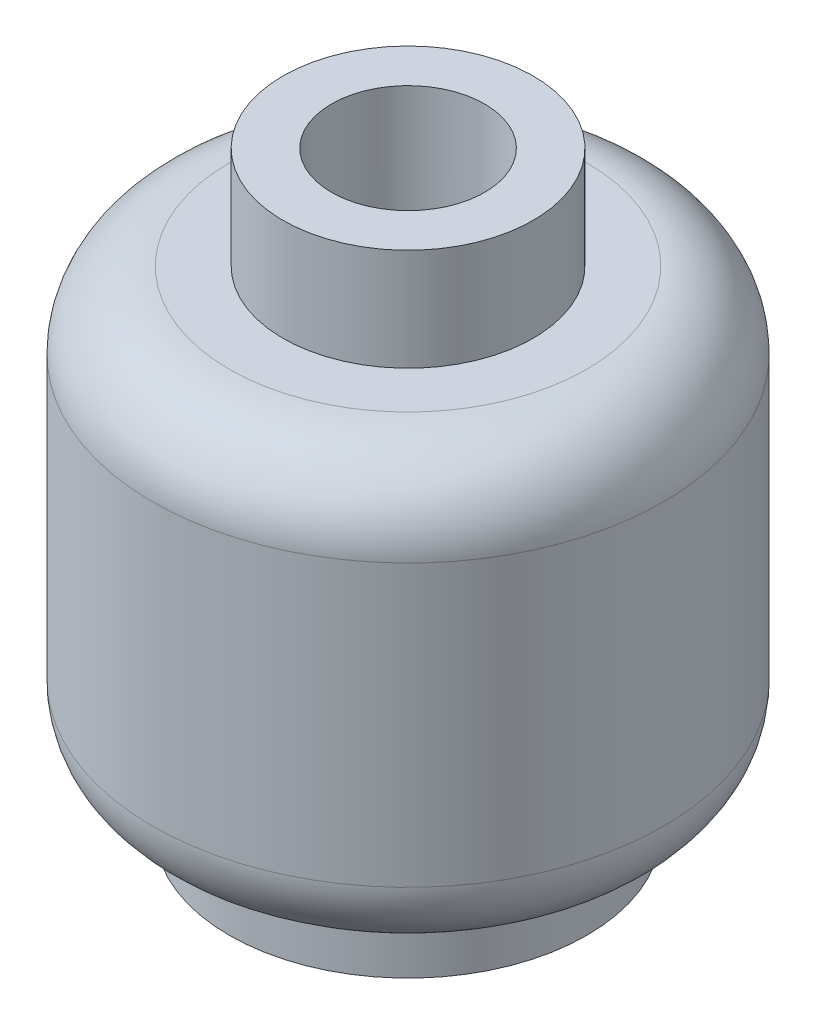
ISO-10303-21;
HEADER;
FILE_DESCRIPTION(('STEP AP214'),'2;1');
FILE_NAME('part.step','',(''),(''),'','','');
FILE_SCHEMA(('AUTOMOTIVE_DESIGN { 1 0 10303 214 1 1 1 1 }'));
ENDSEC;
DATA;
#1=APPLICATION_CONTEXT('core data for automotive mechanical design processes');
#2=APPLICATION_PROTOCOL_DEFINITION('international standard','automotive_design',2000,#1);
#3=PRODUCT_CONTEXT('',#1,'mechanical');
#4=PRODUCT('Part','Part','',(#3));
#5=PRODUCT_RELATED_PRODUCT_CATEGORY('part','',(#4));
#6=PRODUCT_DEFINITION_FORMATION('','',#4);
#7=PRODUCT_DEFINITION_CONTEXT('part definition',#1,'design');
#8=PRODUCT_DEFINITION('design','',#6,#7);
#9=PRODUCT_DEFINITION_SHAPE('','',#8);
#10=(LENGTH_UNIT() NAMED_UNIT(*) SI_UNIT(.MILLI.,.METRE.));
#11=(NAMED_UNIT(*) PLANE_ANGLE_UNIT() SI_UNIT($,.RADIAN.));
#12=(NAMED_UNIT(*) SI_UNIT($,.STERADIAN.) SOLID_ANGLE_UNIT());
#13=UNCERTAINTY_MEASURE_WITH_UNIT(LENGTH_MEASURE(1.E-05),#10,'distance_accuracy_value','');
#14=(GEOMETRIC_REPRESENTATION_CONTEXT(3) GLOBAL_UNCERTAINTY_ASSIGNED_CONTEXT((#13)) GLOBAL_UNIT_ASSIGNED_CONTEXT((#10,
#11,#12)) REPRESENTATION_CONTEXT('',''));
#15=CARTESIAN_POINT('',(0.,0.,0.));
#16=DIRECTION('',(0.,0.,1.));
#17=DIRECTION('',(1.,0.,0.));
#18=AXIS2_PLACEMENT_3D('',#15,#16,#17);
#19=CARTESIAN_POINT('',(0.,42.6874995597848,0.));
#20=DIRECTION('',(0.,-1.,0.));
#21=DIRECTION('',(0.,0.,-1.));
#22=AXIS2_PLACEMENT_3D('',#19,#20,#21);
#23=PLANE('',#22);
#24=CARTESIAN_POINT('',(0.,42.6874995597848,0.));
#25=DIRECTION('',(0.,-1.,0.));
#26=DIRECTION('',(0.,0.,-1.));
#27=AXIS2_PLACEMENT_3D('',#24,#25,#26);
#28=CIRCLE('',#27,1.5);
#29=CARTESIAN_POINT('',(-1.47532031159032,42.6874995597848,0.270979663829283));
#30=VERTEX_POINT('',#29);
#31=CARTESIAN_POINT('',(-0.4,42.6874995597848,-1.4456832294801));
#32=VERTEX_POINT('',#31);
#33=EDGE_CURVE('E142',#30,#32,#28,.T.);
#34=ORIENTED_EDGE('',*,*,#33,.F.);
#35=DIRECTION('',(0.86602540378444,0.,-0.499999999999998));
#36=VECTOR('',#35,1.);
#37=CARTESIAN_POINT('',(-0.251492441505015,42.6874995597848,-0.435597686406233));
#38=LINE('',#37,#36);
#39=CARTESIAN_POINT('',(-0.4,42.6874995597848,-0.34985680753246));
#40=VERTEX_POINT('',#39);
#41=EDGE_CURVE('E139',#30,#40,#38,.T.);
#42=ORIENTED_EDGE('',*,*,#41,.T.);
#43=DIRECTION('',(0.,0.,-1.));
#44=VECTOR('',#43,1.);
#45=CARTESIAN_POINT('',(-0.4,42.6874995597848,0.));
#46=LINE('',#45,#44);
#47=EDGE_CURVE('E178',#40,#32,#46,.T.);
#48=ORIENTED_EDGE('',*,*,#47,.T.);
#49=EDGE_LOOP('',(#34,#42,#48));
#50=FACE_BOUND('',#49,.T.);
#51=CARTESIAN_POINT('',(0.,42.6874995597848,0.));
#52=DIRECTION('',(0.,-1.,0.));
#53=DIRECTION('',(0.,0.,-1.));
#54=AXIS2_PLACEMENT_3D('',#51,#52,#53);
#55=CIRCLE('',#54,2.40163194811015);
#56=CARTESIAN_POINT('',(0.,42.6874995597848,-2.40163194811015));
#57=VERTEX_POINT('',#56);
#58=EDGE_CURVE('E130',#57,#57,#55,.T.);
#59=ORIENTED_EDGE('',*,*,#58,.T.);
#60=EDGE_LOOP('',(#59));
#61=FACE_BOUND('',#60,.T.);
#62=DIRECTION('',(0.,0.,-1.));
#63=VECTOR('',#62,1.);
#64=CARTESIAN_POINT('',(0.4,42.6874995597848,0.));
#65=LINE('',#64,#63);
#66=CARTESIAN_POINT('',(0.4,42.6874995597848,-0.349856807532461));
#67=VERTEX_POINT('',#66);
#68=CARTESIAN_POINT('',(0.4,42.6874995597848,-1.4456832294801));
#69=VERTEX_POINT('',#68);
#70=EDGE_CURVE('E349',#67,#69,#65,.T.);
#71=ORIENTED_EDGE('',*,*,#70,.F.);
#72=DIRECTION('',(-0.86602540378444,0.,-0.499999999999998));
#73=VECTOR('',#72,1.);
#74=CARTESIAN_POINT('',(0.251492441505016,42.6874995597848,-0.435597686406234));
#75=LINE('',#74,#73);
#76=CARTESIAN_POINT('',(1.47532031159032,42.6874995597848,0.270979663829281));
#77=VERTEX_POINT('',#76);
#78=EDGE_CURVE('E344',#77,#67,#75,.T.);
#79=ORIENTED_EDGE('',*,*,#78,.F.);
#80=CARTESIAN_POINT('',(0.,42.6874995597848,0.));
#81=DIRECTION('',(0.,-1.,0.));
#82=DIRECTION('',(0.,0.,-1.));
#83=AXIS2_PLACEMENT_3D('',#80,#81,#82);
#84=CIRCLE('',#83,1.5);
#85=EDGE_CURVE('E180',#69,#77,#84,.T.);
#86=ORIENTED_EDGE('',*,*,#85,.F.);
#87=EDGE_LOOP('',(#71,#79,#86));
#88=FACE_BOUND('',#87,.T.);
#89=CARTESIAN_POINT('',(0.,42.6874995597848,0.));
#90=DIRECTION('',(0.,-1.,0.));
#91=DIRECTION('',(0.,0.,-1.));
#92=AXIS2_PLACEMENT_3D('',#89,#90,#91);
#93=CIRCLE('',#92,1.5);
#94=CARTESIAN_POINT('',(1.12480957215613,42.6874995597848,0.992372624766496));
#95=VERTEX_POINT('',#94);
#96=CARTESIAN_POINT('',(-1.12480957215613,42.6874995597848,0.992372624766497));
#97=VERTEX_POINT('',#96);
#98=EDGE_CURVE('E119',#95,#97,#93,.T.);
#99=ORIENTED_EDGE('',*,*,#98,.F.);
#100=DIRECTION('',(-0.86602540378444,0.,-0.499999999999997));
#101=VECTOR('',#100,1.);
#102=CARTESIAN_POINT('',(-0.148507558494983,42.6874995597848,0.257222636621319));
#103=LINE('',#102,#101);
#104=CARTESIAN_POINT('',(0.,42.6874995597848,0.342963515495091));
#105=VERTEX_POINT('',#104);
#106=EDGE_CURVE('E325',#95,#105,#103,.T.);
#107=ORIENTED_EDGE('',*,*,#106,.T.);
#108=DIRECTION('',(-0.86602540378444,0.,0.499999999999998));
#109=VECTOR('',#108,1.);
#110=CARTESIAN_POINT('',(0.148507558494983,42.6874995597848,0.257222636621319));
#111=LINE('',#110,#109);
#112=EDGE_CURVE('E107',#105,#97,#111,.T.);
#113=ORIENTED_EDGE('',*,*,#112,.T.);
#114=EDGE_LOOP('',(#99,#107,#113));
#115=FACE_BOUND('',#114,.T.);
#116=ADVANCED_FACE('F34',(#50,#61,#88,#115),#23,.T.);
#117=CARTESIAN_POINT('',(0.,43.7874995597848,0.));
#118=DIRECTION('',(0.,1.,0.));
#119=DIRECTION('',(-1.,0.,0.));
#120=AXIS2_PLACEMENT_3D('',#117,#118,#119);
#121=PLANE('',#120);
#122=DIRECTION('',(0.86602540378444,0.,-0.499999999999998));
#123=VECTOR('',#122,1.);
#124=CARTESIAN_POINT('',(0.148507558494983,43.7874995597848,0.257222636621319));
#125=LINE('',#124,#123);
#126=CARTESIAN_POINT('',(-1.12480957215613,43.7874995597848,0.992372624766497));
#127=VERTEX_POINT('',#126);
#128=CARTESIAN_POINT('',(0.,43.7874995597848,0.342963515495091));
#129=VERTEX_POINT('',#128);
#130=EDGE_CURVE('E102',#127,#129,#125,.T.);
#131=ORIENTED_EDGE('',*,*,#130,.T.);
#132=DIRECTION('',(0.86602540378444,0.,0.499999999999997));
#133=VECTOR('',#132,1.);
#134=CARTESIAN_POINT('',(-0.148507558494983,43.7874995597848,0.257222636621319));
#135=LINE('',#134,#133);
#136=CARTESIAN_POINT('',(1.12480957215613,43.7874995597848,0.992372624766496));
#137=VERTEX_POINT('',#136);
#138=EDGE_CURVE('E323',#129,#137,#135,.T.);
#139=ORIENTED_EDGE('',*,*,#138,.T.);
#140=CARTESIAN_POINT('',(0.,43.7874995597848,0.));
#141=DIRECTION('',(0.,1.,0.));
#142=DIRECTION('',(-1.,0.,0.));
#143=AXIS2_PLACEMENT_3D('',#140,#141,#142);
#144=CIRCLE('',#143,1.5);
#145=CARTESIAN_POINT('',(1.47532031159032,43.7874995597848,0.270979663829281));
#146=VERTEX_POINT('',#145);
#147=EDGE_CURVE('E126',#137,#146,#144,.T.);
#148=ORIENTED_EDGE('',*,*,#147,.T.);
#149=DIRECTION('',(0.86602540378444,0.,0.499999999999998));
#150=VECTOR('',#149,1.);
#151=CARTESIAN_POINT('',(0.251492441505016,43.7874995597848,-0.435597686406234));
#152=LINE('',#151,#150);
#153=CARTESIAN_POINT('',(0.4,43.7874995597848,-0.349856807532461));
#154=VERTEX_POINT('',#153);
#155=EDGE_CURVE('E338',#154,#146,#152,.T.);
#156=ORIENTED_EDGE('',*,*,#155,.F.);
#157=DIRECTION('',(0.,0.,1.));
#158=VECTOR('',#157,1.);
#159=CARTESIAN_POINT('',(0.4,43.7874995597848,0.));
#160=LINE('',#159,#158);
#161=CARTESIAN_POINT('',(0.4,43.7874995597848,-1.4456832294801));
#162=VERTEX_POINT('',#161);
#163=EDGE_CURVE('E346',#162,#154,#160,.T.);
#164=ORIENTED_EDGE('',*,*,#163,.F.);
#165=CARTESIAN_POINT('',(-0.4,43.7874995597848,-1.4456832294801));
#166=VERTEX_POINT('',#165);
#167=EDGE_CURVE('E128',#162,#166,#144,.T.);
#168=ORIENTED_EDGE('',*,*,#167,.T.);
#169=DIRECTION('',(0.,0.,1.));
#170=VECTOR('',#169,1.);
#171=CARTESIAN_POINT('',(-0.4,43.7874995597848,0.));
#172=LINE('',#171,#170);
#173=CARTESIAN_POINT('',(-0.4,43.7874995597848,-0.34985680753246));
#174=VERTEX_POINT('',#173);
#175=EDGE_CURVE('E42',#166,#174,#172,.T.);
#176=ORIENTED_EDGE('',*,*,#175,.T.);
#177=DIRECTION('',(-0.86602540378444,0.,0.499999999999998));
#178=VECTOR('',#177,1.);
#179=CARTESIAN_POINT('',(-0.251492441505015,43.7874995597848,-0.435597686406233));
#180=LINE('',#179,#178);
#181=CARTESIAN_POINT('',(-1.47532031159032,43.7874995597848,0.270979663829283));
#182=VERTEX_POINT('',#181);
#183=EDGE_CURVE('E11',#174,#182,#180,.T.);
#184=ORIENTED_EDGE('',*,*,#183,.T.);
#185=EDGE_CURVE('E116',#182,#127,#144,.T.);
#186=ORIENTED_EDGE('',*,*,#185,.T.);
#187=EDGE_LOOP('',(#131,#139,#148,#156,#164,#168,#176,#184,#186));
#188=FACE_BOUND('',#187,.T.);
#189=ADVANCED_FACE('F122',(#188),#121,.T.);
#190=CARTESIAN_POINT('',(3.49999999999999,34.1874995597848,0.));
#191=DIRECTION('',(0.,1.,0.));
#192=DIRECTION('',(-1.,0.,0.));
#193=AXIS2_PLACEMENT_3D('',#190,#191,#192);
#194=PLANE('',#193);
#195=CARTESIAN_POINT('',(0.,34.1874995597848,0.));
#196=DIRECTION('',(0.,-1.,0.));
#197=DIRECTION('',(0.,0.,-1.));
#198=AXIS2_PLACEMENT_3D('',#195,#196,#197);
#199=CIRCLE('',#198,2.55);
#200=CARTESIAN_POINT('',(0.,34.1874995597848,-2.55));
#201=VERTEX_POINT('',#200);
#202=EDGE_CURVE('E125',#201,#201,#199,.T.);
#203=ORIENTED_EDGE('',*,*,#202,.F.);
#204=EDGE_LOOP('',(#203));
#205=FACE_BOUND('',#204,.T.);
#206=CARTESIAN_POINT('',(0.,34.1874995597848,0.));
#207=DIRECTION('',(0.,1.,0.));
#208=DIRECTION('',(-1.,0.,0.));
#209=AXIS2_PLACEMENT_3D('',#206,#207,#208);
#210=CIRCLE('',#209,3.49999999999999);
#211=CARTESIAN_POINT('',(-3.49999999999999,34.1874995597848,0.));
#212=VERTEX_POINT('',#211);
#213=EDGE_CURVE('E164',#212,#212,#210,.T.);
#214=ORIENTED_EDGE('',*,*,#213,.F.);
#215=EDGE_LOOP('',(#214));
#216=FACE_BOUND('',#215,.T.);
#217=ADVANCED_FACE('F36',(#205,#216),#194,.F.);
#218=CARTESIAN_POINT('',(0.,45.7874995597848,0.));
#219=DIRECTION('',(0.,1.,0.));
#220=DIRECTION('',(-1.,0.,0.));
#221=AXIS2_PLACEMENT_3D('',#218,#219,#220);
#222=CYLINDRICAL_SURFACE('',#221,3.49999999999999);
#223=CARTESIAN_POINT('',(0.,35.2874995597848,0.));
#224=DIRECTION('',(0.,1.,0.));
#225=DIRECTION('',(-1.,0.,0.));
#226=AXIS2_PLACEMENT_3D('',#223,#224,#225);
#227=CIRCLE('',#226,3.49999999999999);
#228=CARTESIAN_POINT('',(-3.49999999999999,35.2874995597848,0.));
#229=VERTEX_POINT('',#228);
#230=EDGE_CURVE('E161',#229,#229,#227,.T.);
#231=ORIENTED_EDGE('',*,*,#230,.F.);
#232=EDGE_LOOP('',(#231));
#233=FACE_BOUND('',#232,.T.);
#234=ORIENTED_EDGE('',*,*,#213,.T.);
#235=EDGE_LOOP('',(#234));
#236=FACE_BOUND('',#235,.T.);
#237=ADVANCED_FACE('F231',(#233,#236),#222,.T.);
#238=CARTESIAN_POINT('',(0.,36.7874995597848,0.));
#239=DIRECTION('',(0.,1.,0.));
#240=DIRECTION('',(-1.,0.,0.));
#241=AXIS2_PLACEMENT_3D('',#238,#239,#240);
#242=TOROIDAL_SURFACE('',#241,3.49999999999999,1.5);
#243=CARTESIAN_POINT('',(0.,36.7874995597848,0.));
#244=DIRECTION('',(0.,1.,0.));
#245=DIRECTION('',(-1.,0.,0.));
#246=AXIS2_PLACEMENT_3D('',#243,#244,#245);
#247=CIRCLE('',#246,4.99999999999999);
#248=CARTESIAN_POINT('',(-4.99999999999999,36.7874995597848,0.));
#249=VERTEX_POINT('',#248);
#250=EDGE_CURVE('E158',#249,#249,#247,.T.);
#251=ORIENTED_EDGE('',*,*,#250,.F.);
#252=EDGE_LOOP('',(#251));
#253=FACE_BOUND('',#252,.T.);
#254=ORIENTED_EDGE('',*,*,#230,.T.);
#255=EDGE_LOOP('',(#254));
#256=FACE_BOUND('',#255,.T.);
#257=ADVANCED_FACE('F228',(#253,#256),#242,.T.);
#258=CARTESIAN_POINT('',(0.,45.7874995597848,0.));
#259=DIRECTION('',(0.,1.,0.));
#260=DIRECTION('',(-1.,0.,0.));
#261=AXIS2_PLACEMENT_3D('',#258,#259,#260);
#262=CYLINDRICAL_SURFACE('',#261,5.);
#263=CARTESIAN_POINT('',(0.,42.2874995597848,0.));
#264=DIRECTION('',(0.,1.,0.));
#265=DIRECTION('',(-1.,0.,0.));
#266=AXIS2_PLACEMENT_3D('',#263,#264,#265);
#267=CIRCLE('',#266,5.00000000000001);
#268=CARTESIAN_POINT('',(-5.00000000000001,42.2874995597848,0.));
#269=VERTEX_POINT('',#268);
#270=EDGE_CURVE('E155',#269,#269,#267,.T.);
#271=ORIENTED_EDGE('',*,*,#270,.F.);
#272=EDGE_LOOP('',(#271));
#273=FACE_BOUND('',#272,.T.);
#274=ORIENTED_EDGE('',*,*,#250,.T.);
#275=EDGE_LOOP('',(#274));
#276=FACE_BOUND('',#275,.T.);
#277=ADVANCED_FACE('F224',(#273,#276),#262,.T.);
#278=CARTESIAN_POINT('',(0.,42.2874995597848,0.));
#279=DIRECTION('',(0.,1.,0.));
#280=DIRECTION('',(-1.,0.,0.));
#281=AXIS2_PLACEMENT_3D('',#278,#279,#280);
#282=TOROIDAL_SURFACE('',#281,3.5,1.5);
#283=CARTESIAN_POINT('',(0.,43.7874995597848,0.));
#284=DIRECTION('',(0.,1.,0.));
#285=DIRECTION('',(-1.,0.,0.));
#286=AXIS2_PLACEMENT_3D('',#283,#284,#285);
#287=CIRCLE('',#286,3.5);
#288=CARTESIAN_POINT('',(-3.5,43.7874995597848,0.));
#289=VERTEX_POINT('',#288);
#290=EDGE_CURVE('E152',#289,#289,#287,.T.);
#291=ORIENTED_EDGE('',*,*,#290,.F.);
#292=EDGE_LOOP('',(#291));
#293=FACE_BOUND('',#292,.T.);
#294=ORIENTED_EDGE('',*,*,#270,.T.);
#295=EDGE_LOOP('',(#294));
#296=FACE_BOUND('',#295,.T.);
#297=ADVANCED_FACE('F220',(#293,#296),#282,.T.);
#298=CARTESIAN_POINT('',(2.45,43.7874995597848,0.));
#299=DIRECTION('',(0.,-1.,0.));
#300=DIRECTION('',(1.,0.,0.));
#301=AXIS2_PLACEMENT_3D('',#298,#299,#300);
#302=PLANE('',#301);
#303=CARTESIAN_POINT('',(0.,43.7874995597848,0.));
#304=DIRECTION('',(0.,1.,0.));
#305=DIRECTION('',(-1.,0.,0.));
#306=AXIS2_PLACEMENT_3D('',#303,#304,#305);
#307=CIRCLE('',#306,2.45);
#308=CARTESIAN_POINT('',(-2.45,43.7874995597848,0.));
#309=VERTEX_POINT('',#308);
#310=EDGE_CURVE('E149',#309,#309,#307,.T.);
#311=ORIENTED_EDGE('',*,*,#310,.F.);
#312=EDGE_LOOP('',(#311));
#313=FACE_BOUND('',#312,.T.);
#314=ORIENTED_EDGE('',*,*,#290,.T.);
#315=EDGE_LOOP('',(#314));
#316=FACE_BOUND('',#315,.T.);
#317=ADVANCED_FACE('F216',(#313,#316),#302,.F.);
#318=CARTESIAN_POINT('',(0.,45.7874995597848,0.));
#319=DIRECTION('',(0.,1.,0.));
#320=DIRECTION('',(-1.,0.,0.));
#321=AXIS2_PLACEMENT_3D('',#318,#319,#320);
#322=CYLINDRICAL_SURFACE('',#321,2.45);
#323=CARTESIAN_POINT('',(0.,45.7874995597848,0.));
#324=DIRECTION('',(0.,1.,0.));
#325=DIRECTION('',(-1.,0.,0.));
#326=AXIS2_PLACEMENT_3D('',#323,#324,#325);
#327=CIRCLE('',#326,2.45);
#328=CARTESIAN_POINT('',(-2.45,45.7874995597848,0.));
#329=VERTEX_POINT('',#328);
#330=EDGE_CURVE('E146',#329,#329,#327,.T.);
#331=ORIENTED_EDGE('',*,*,#330,.F.);
#332=EDGE_LOOP('',(#331));
#333=FACE_BOUND('',#332,.T.);
#334=ORIENTED_EDGE('',*,*,#310,.T.);
#335=EDGE_LOOP('',(#334));
#336=FACE_BOUND('',#335,.T.);
#337=ADVANCED_FACE('F212',(#333,#336),#322,.T.);
#338=CARTESIAN_POINT('',(0.,45.7874995597848,0.));
#339=DIRECTION('',(0.,-1.,0.));
#340=DIRECTION('',(1.,0.,0.));
#341=AXIS2_PLACEMENT_3D('',#338,#339,#340);
#342=PLANE('',#341);
#343=CARTESIAN_POINT('',(0.,45.7874995597848,0.));
#344=DIRECTION('',(0.,1.,0.));
#345=DIRECTION('',(-1.,0.,0.));
#346=AXIS2_PLACEMENT_3D('',#343,#344,#345);
#347=CIRCLE('',#346,1.5);
#348=CARTESIAN_POINT('',(-1.5,45.7874995597848,0.));
#349=VERTEX_POINT('',#348);
#350=EDGE_CURVE('E134',#349,#349,#347,.T.);
#351=ORIENTED_EDGE('',*,*,#350,.F.);
#352=EDGE_LOOP('',(#351));
#353=FACE_BOUND('',#352,.T.);
#354=ORIENTED_EDGE('',*,*,#330,.T.);
#355=EDGE_LOOP('',(#354));
#356=FACE_BOUND('',#355,.T.);
#357=ADVANCED_FACE('F208',(#353,#356),#342,.F.);
#358=CARTESIAN_POINT('',(0.,34.1874995597848,0.));
#359=DIRECTION('',(0.,-1.,0.));
#360=DIRECTION('',(0.,0.,-1.));
#361=AXIS2_PLACEMENT_3D('',#358,#359,#360);
#362=CONICAL_SURFACE('',#361,2.55,0.0174532925199433);
#363=ORIENTED_EDGE('',*,*,#58,.F.);
#364=EDGE_LOOP('',(#363));
#365=FACE_BOUND('',#364,.T.);
#366=ORIENTED_EDGE('',*,*,#202,.T.);
#367=EDGE_LOOP('',(#366));
#368=FACE_BOUND('',#367,.T.);
#369=ADVANCED_FACE('F197',(#365,#368),#362,.F.);
#370=CARTESIAN_POINT('',(0.,43.7874995597848,0.));
#371=DIRECTION('',(0.,1.,0.));
#372=DIRECTION('',(-1.,0.,0.));
#373=AXIS2_PLACEMENT_3D('',#370,#371,#372);
#374=CYLINDRICAL_SURFACE('',#373,1.5);
#375=ORIENTED_EDGE('',*,*,#147,.F.);
#376=DIRECTION('',(0.,1.,0.));
#377=VECTOR('',#376,1.);
#378=CARTESIAN_POINT('',(1.12480957215613,34.1874995597848,0.992372624766496));
#379=LINE('',#378,#377);
#380=EDGE_CURVE('E108',#95,#137,#379,.T.);
#381=ORIENTED_EDGE('',*,*,#380,.F.);
#382=ORIENTED_EDGE('',*,*,#98,.T.);
#383=DIRECTION('',(0.,1.,0.));
#384=VECTOR('',#383,1.);
#385=CARTESIAN_POINT('',(-1.12480957215613,34.1874995597848,0.992372624766497));
#386=LINE('',#385,#384);
#387=EDGE_CURVE('E49',#97,#127,#386,.T.);
#388=ORIENTED_EDGE('',*,*,#387,.T.);
#389=ORIENTED_EDGE('',*,*,#185,.F.);
#390=DIRECTION('',(0.,1.,0.));
#391=VECTOR('',#390,1.);
#392=CARTESIAN_POINT('',(-1.47532031159032,34.1874995597848,0.270979663829283));
#393=LINE('',#392,#391);
#394=EDGE_CURVE('E176',#30,#182,#393,.T.);
#395=ORIENTED_EDGE('',*,*,#394,.F.);
#396=ORIENTED_EDGE('',*,*,#33,.T.);
#397=DIRECTION('',(0.,1.,0.));
#398=VECTOR('',#397,1.);
#399=CARTESIAN_POINT('',(-0.4,34.1874995597848,-1.4456832294801));
#400=LINE('',#399,#398);
#401=EDGE_CURVE('E169',#32,#166,#400,.T.);
#402=ORIENTED_EDGE('',*,*,#401,.T.);
#403=ORIENTED_EDGE('',*,*,#167,.F.);
#404=DIRECTION('',(0.,1.,0.));
#405=VECTOR('',#404,1.);
#406=CARTESIAN_POINT('',(0.4,34.1874995597848,-1.4456832294801));
#407=LINE('',#406,#405);
#408=EDGE_CURVE('E335',#69,#162,#407,.T.);
#409=ORIENTED_EDGE('',*,*,#408,.F.);
#410=ORIENTED_EDGE('',*,*,#85,.T.);
#411=DIRECTION('',(0.,1.,0.));
#412=VECTOR('',#411,1.);
#413=CARTESIAN_POINT('',(1.47532031159032,34.1874995597848,0.270979663829281));
#414=LINE('',#413,#412);
#415=EDGE_CURVE('E332',#77,#146,#414,.T.);
#416=ORIENTED_EDGE('',*,*,#415,.T.);
#417=EDGE_LOOP('',(#375,#381,#382,#388,#389,#395,#396,#402,#403,#409,#410,#416));
#418=FACE_BOUND('',#417,.T.);
#419=ORIENTED_EDGE('',*,*,#350,.T.);
#420=EDGE_LOOP('',(#419));
#421=FACE_BOUND('',#420,.T.);
#422=ADVANCED_FACE('F113',(#418,#421),#374,.F.);
#423=CARTESIAN_POINT('',(-0.251492441505015,34.1874995597848,-0.435597686406233));
#424=DIRECTION('',(-0.499999999999998,0.,-0.86602540378444));
#425=DIRECTION('',(-0.86602540378444,0.,0.499999999999998));
#426=AXIS2_PLACEMENT_3D('',#423,#424,#425);
#427=PLANE('',#426);
#428=ORIENTED_EDGE('',*,*,#394,.T.);
#429=ORIENTED_EDGE('',*,*,#183,.F.);
#430=DIRECTION('',(0.,1.,0.));
#431=VECTOR('',#430,1.);
#432=CARTESIAN_POINT('',(-0.4,34.1874995597848,-0.34985680753246));
#433=LINE('',#432,#431);
#434=EDGE_CURVE('E172',#40,#174,#433,.T.);
#435=ORIENTED_EDGE('',*,*,#434,.F.);
#436=ORIENTED_EDGE('',*,*,#41,.F.);
#437=EDGE_LOOP('',(#428,#429,#435,#436));
#438=FACE_BOUND('',#437,.T.);
#439=ADVANCED_FACE('F188',(#438),#427,.T.);
#440=CARTESIAN_POINT('',(-0.4,34.1874995597848,0.));
#441=DIRECTION('',(-1.,0.,0.));
#442=DIRECTION('',(0.,0.,1.));
#443=AXIS2_PLACEMENT_3D('',#440,#441,#442);
#444=PLANE('',#443);
#445=ORIENTED_EDGE('',*,*,#434,.T.);
#446=ORIENTED_EDGE('',*,*,#175,.F.);
#447=ORIENTED_EDGE('',*,*,#401,.F.);
#448=ORIENTED_EDGE('',*,*,#47,.F.);
#449=EDGE_LOOP('',(#445,#446,#447,#448));
#450=FACE_BOUND('',#449,.T.);
#451=ADVANCED_FACE('F168',(#450),#444,.T.);
#452=CARTESIAN_POINT('',(0.4,34.1874995597848,0.));
#453=DIRECTION('',(-1.,0.,0.));
#454=DIRECTION('',(0.,0.,1.));
#455=AXIS2_PLACEMENT_3D('',#452,#453,#454);
#456=PLANE('',#455);
#457=ORIENTED_EDGE('',*,*,#70,.T.);
#458=ORIENTED_EDGE('',*,*,#408,.T.);
#459=ORIENTED_EDGE('',*,*,#163,.T.);
#460=DIRECTION('',(0.,1.,0.));
#461=VECTOR('',#460,1.);
#462=CARTESIAN_POINT('',(0.4,34.1874995597848,-0.349856807532461));
#463=LINE('',#462,#461);
#464=EDGE_CURVE('E336',#67,#154,#463,.T.);
#465=ORIENTED_EDGE('',*,*,#464,.F.);
#466=EDGE_LOOP('',(#457,#458,#459,#465));
#467=FACE_BOUND('',#466,.T.);
#468=ADVANCED_FACE('F195',(#467),#456,.F.);
#469=CARTESIAN_POINT('',(0.251492441505016,34.1874995597848,-0.435597686406234));
#470=DIRECTION('',(-0.499999999999998,0.,0.86602540378444));
#471=DIRECTION('',(0.86602540378444,0.,0.499999999999998));
#472=AXIS2_PLACEMENT_3D('',#469,#470,#471);
#473=PLANE('',#472);
#474=ORIENTED_EDGE('',*,*,#78,.T.);
#475=ORIENTED_EDGE('',*,*,#464,.T.);
#476=ORIENTED_EDGE('',*,*,#155,.T.);
#477=ORIENTED_EDGE('',*,*,#415,.F.);
#478=EDGE_LOOP('',(#474,#475,#476,#477));
#479=FACE_BOUND('',#478,.T.);
#480=ADVANCED_FACE('F291',(#479),#473,.F.);
#481=CARTESIAN_POINT('',(-0.148507558494983,34.1874995597848,0.257222636621319));
#482=DIRECTION('',(-0.499999999999997,0.,0.86602540378444));
#483=DIRECTION('',(0.86602540378444,0.,0.499999999999997));
#484=AXIS2_PLACEMENT_3D('',#481,#482,#483);
#485=PLANE('',#484);
#486=ORIENTED_EDGE('',*,*,#380,.T.);
#487=ORIENTED_EDGE('',*,*,#138,.F.);
#488=DIRECTION('',(0.,1.,0.));
#489=VECTOR('',#488,1.);
#490=CARTESIAN_POINT('',(0.,34.1874995597848,0.342963515495091));
#491=LINE('',#490,#489);
#492=EDGE_CURVE('E54',#105,#129,#491,.T.);
#493=ORIENTED_EDGE('',*,*,#492,.F.);
#494=ORIENTED_EDGE('',*,*,#106,.F.);
#495=EDGE_LOOP('',(#486,#487,#493,#494));
#496=FACE_BOUND('',#495,.T.);
#497=ADVANCED_FACE('F301',(#496),#485,.T.);
#498=CARTESIAN_POINT('',(0.148507558494983,34.1874995597848,0.257222636621319));
#499=DIRECTION('',(0.499999999999998,0.,0.86602540378444));
#500=DIRECTION('',(0.86602540378444,0.,-0.499999999999998));
#501=AXIS2_PLACEMENT_3D('',#498,#499,#500);
#502=PLANE('',#501);
#503=ORIENTED_EDGE('',*,*,#492,.T.);
#504=ORIENTED_EDGE('',*,*,#130,.F.);
#505=ORIENTED_EDGE('',*,*,#387,.F.);
#506=ORIENTED_EDGE('',*,*,#112,.F.);
#507=EDGE_LOOP('',(#503,#504,#505,#506));
#508=FACE_BOUND('',#507,.T.);
#509=ADVANCED_FACE('F103',(#508),#502,.T.);
#510=CLOSED_SHELL('',(#116,#189,#217,#237,#257,#277,#297,#317,#337,#357,#369,#422,#439,#451,
#468,#480,#497,#509));
#511=MANIFOLD_SOLID_BREP('B2',#510);
#512=ADVANCED_BREP_SHAPE_REPRESENTATION('',(#18,#511),#14);
#513=SHAPE_DEFINITION_REPRESENTATION(#9,#512);
ENDSEC;
END-ISO-10303-21;
